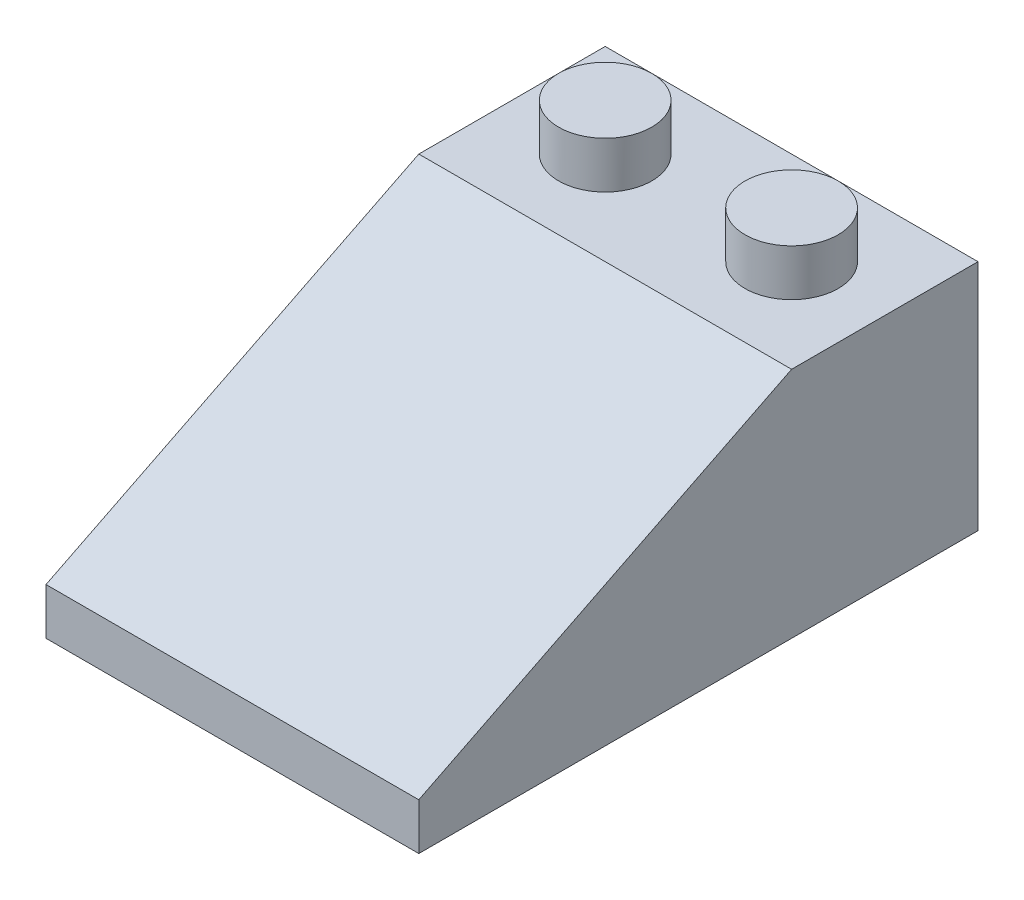
ISO-10303-21;
HEADER;
FILE_DESCRIPTION(('STEP AP214'),'2;1');
FILE_NAME('part.step','',(''),(''),'','','');
FILE_SCHEMA(('AUTOMOTIVE_DESIGN { 1 0 10303 214 1 1 1 1 }'));
ENDSEC;
DATA;
#1=APPLICATION_CONTEXT('core data for automotive mechanical design processes');
#2=APPLICATION_PROTOCOL_DEFINITION('international standard','automotive_design',2000,#1);
#3=PRODUCT_CONTEXT('',#1,'mechanical');
#4=PRODUCT('Part','Part','',(#3));
#5=PRODUCT_RELATED_PRODUCT_CATEGORY('part','',(#4));
#6=PRODUCT_DEFINITION_FORMATION('','',#4);
#7=PRODUCT_DEFINITION_CONTEXT('part definition',#1,'design');
#8=PRODUCT_DEFINITION('design','',#6,#7);
#9=PRODUCT_DEFINITION_SHAPE('','',#8);
#10=(LENGTH_UNIT() NAMED_UNIT(*) SI_UNIT(.MILLI.,.METRE.));
#11=(NAMED_UNIT(*) PLANE_ANGLE_UNIT() SI_UNIT($,.RADIAN.));
#12=(NAMED_UNIT(*) SI_UNIT($,.STERADIAN.) SOLID_ANGLE_UNIT());
#13=UNCERTAINTY_MEASURE_WITH_UNIT(LENGTH_MEASURE(1.E-05),#10,'distance_accuracy_value','');
#14=(GEOMETRIC_REPRESENTATION_CONTEXT(3) GLOBAL_UNCERTAINTY_ASSIGNED_CONTEXT((#13)) GLOBAL_UNIT_ASSIGNED_CONTEXT((#10,
#11,#12)) REPRESENTATION_CONTEXT('',''));
#15=CARTESIAN_POINT('',(0.,0.,0.));
#16=DIRECTION('',(0.,0.,1.));
#17=DIRECTION('',(1.,0.,0.));
#18=AXIS2_PLACEMENT_3D('',#15,#16,#17);
#19=CARTESIAN_POINT('',(8.,7.10557280900008,-16.4472135955));
#20=DIRECTION('',(0.,-0.894427190999916,-0.447213595499958));
#21=DIRECTION('',(0.,0.447213595499958,-0.894427190999916));
#22=AXIS2_PLACEMENT_3D('',#19,#20,#21);
#23=PLANE('',#22);
#24=CARTESIAN_POINT('',(0.,2.88196601127311,-8.));
#25=DIRECTION('',(0.,-0.894427190999916,-0.447213595499958));
#26=DIRECTION('',(0.,-0.447213595499958,0.894427190999916));
#27=AXIS2_PLACEMENT_3D('',#24,#25,#26);
#28=ELLIPSE('',#27,3.01869176962472,2.7);
#29=CARTESIAN_POINT('',(0.,1.53196601127311,-5.3));
#30=VERTEX_POINT('',#29);
#31=EDGE_CURVE('E194',#30,#30,#28,.T.);
#32=ORIENTED_EDGE('',*,*,#31,.F.);
#33=EDGE_LOOP('',(#32));
#34=FACE_BOUND('',#33,.T.);
#35=DIRECTION('',(-1.,0.,0.));
#36=VECTOR('',#35,1.);
#37=CARTESIAN_POINT('',(8.,7.,-16.2360679774998));
#38=LINE('',#37,#36);
#39=CARTESIAN_POINT('',(-2.68966018485592,7.000000000005,-16.2360679774998));
#40=VERTEX_POINT('',#39);
#41=CARTESIAN_POINT('',(-7.,7.,-16.2360679774998));
#42=VERTEX_POINT('',#41);
#43=EDGE_CURVE('E144',#40,#42,#38,.T.);
#44=ORIENTED_EDGE('',*,*,#43,.F.);
#45=CARTESIAN_POINT('',(0.,6.88196601123536,-16.));
#46=DIRECTION('',(0.,-0.894427190999916,-0.447213595499958));
#47=DIRECTION('',(0.,-0.447213595499958,0.894427190999916));
#48=AXIS2_PLACEMENT_3D('',#45,#46,#47);
#49=ELLIPSE('',#48,3.01869176962472,2.7);
#50=CARTESIAN_POINT('',(2.68966018485592,7.000000000005,-16.2360679774998));
#51=VERTEX_POINT('',#50);
#52=EDGE_CURVE('E58',#51,#40,#49,.T.);
#53=ORIENTED_EDGE('',*,*,#52,.F.);
#54=CARTESIAN_POINT('',(7.,7.,-16.2360679774998));
#55=VERTEX_POINT('',#54);
#56=EDGE_CURVE('E141',#55,#51,#38,.T.);
#57=ORIENTED_EDGE('',*,*,#56,.F.);
#58=DIRECTION('',(0.,-0.447213595499958,0.894427190999916));
#59=VECTOR('',#58,1.);
#60=CARTESIAN_POINT('',(7.,7.10557280900008,-16.4472135955));
#61=LINE('',#60,#59);
#62=CARTESIAN_POINT('',(7.,-0.618033988749895,-1.));
#63=VERTEX_POINT('',#62);
#64=EDGE_CURVE('E179',#55,#63,#61,.T.);
#65=ORIENTED_EDGE('',*,*,#64,.T.);
#66=DIRECTION('',(-1.,0.,0.));
#67=VECTOR('',#66,1.);
#68=CARTESIAN_POINT('',(8.,-0.618033988749895,-1.));
#69=LINE('',#68,#67);
#70=CARTESIAN_POINT('',(-7.,-0.618033988749895,-1.));
#71=VERTEX_POINT('',#70);
#72=EDGE_CURVE('E175',#63,#71,#69,.T.);
#73=ORIENTED_EDGE('',*,*,#72,.T.);
#74=DIRECTION('',(0.,-0.447213595499958,0.894427190999916));
#75=VECTOR('',#74,1.);
#76=CARTESIAN_POINT('',(-7.,7.10557280900008,-16.4472135955));
#77=LINE('',#76,#75);
#78=EDGE_CURVE('E170',#42,#71,#77,.T.);
#79=ORIENTED_EDGE('',*,*,#78,.F.);
#80=EDGE_LOOP('',(#44,#53,#57,#65,#73,#79));
#81=FACE_BOUND('',#80,.T.);
#82=ADVANCED_FACE('F44',(#34,#81),#23,.T.);
#83=CARTESIAN_POINT('',(8.,7.,-24.));
#84=DIRECTION('',(0.,-1.,0.));
#85=DIRECTION('',(0.,0.,-1.));
#86=AXIS2_PLACEMENT_3D('',#83,#84,#85);
#87=PLANE('',#86);
#88=CARTESIAN_POINT('',(4.,7.,-20.));
#89=DIRECTION('',(0.,-1.,0.));
#90=DIRECTION('',(0.,0.,-1.));
#91=AXIS2_PLACEMENT_3D('',#88,#89,#90);
#92=CIRCLE('',#91,1.);
#93=CARTESIAN_POINT('',(4.,7.,-21.));
#94=VERTEX_POINT('',#93);
#95=EDGE_CURVE('E165',#94,#94,#92,.F.);
#96=ORIENTED_EDGE('',*,*,#95,.T.);
#97=EDGE_LOOP('',(#96));
#98=FACE_BOUND('',#97,.T.);
#99=CARTESIAN_POINT('',(-4.,7.,-20.));
#100=DIRECTION('',(0.,-1.,0.));
#101=DIRECTION('',(0.,0.,-1.));
#102=AXIS2_PLACEMENT_3D('',#99,#100,#101);
#103=CIRCLE('',#102,1.);
#104=CARTESIAN_POINT('',(-4.,7.,-21.));
#105=VERTEX_POINT('',#104);
#106=EDGE_CURVE('E169',#105,#105,#103,.F.);
#107=ORIENTED_EDGE('',*,*,#106,.T.);
#108=EDGE_LOOP('',(#107));
#109=FACE_BOUND('',#108,.T.);
#110=ORIENTED_EDGE('',*,*,#56,.T.);
#111=CARTESIAN_POINT('',(0.,7.000000000005,-16.));
#112=DIRECTION('',(0.,-1.,0.));
#113=DIRECTION('',(0.,0.,-1.));
#114=AXIS2_PLACEMENT_3D('',#111,#112,#113);
#115=CIRCLE('',#114,2.7);
#116=EDGE_CURVE('E130',#40,#51,#115,.T.);
#117=ORIENTED_EDGE('',*,*,#116,.F.);
#118=ORIENTED_EDGE('',*,*,#43,.T.);
#119=DIRECTION('',(0.,0.,1.));
#120=VECTOR('',#119,1.);
#121=CARTESIAN_POINT('',(-7.,7.,-24.));
#122=LINE('',#121,#120);
#123=CARTESIAN_POINT('',(-7.,7.,-23.));
#124=VERTEX_POINT('',#123);
#125=EDGE_CURVE('E182',#124,#42,#122,.T.);
#126=ORIENTED_EDGE('',*,*,#125,.F.);
#127=DIRECTION('',(-1.,0.,0.));
#128=VECTOR('',#127,1.);
#129=CARTESIAN_POINT('',(8.,7.,-23.));
#130=LINE('',#129,#128);
#131=CARTESIAN_POINT('',(7.,7.,-23.));
#132=VERTEX_POINT('',#131);
#133=EDGE_CURVE('E151',#132,#124,#130,.T.);
#134=ORIENTED_EDGE('',*,*,#133,.F.);
#135=DIRECTION('',(0.,0.,1.));
#136=VECTOR('',#135,1.);
#137=CARTESIAN_POINT('',(7.,7.,-24.));
#138=LINE('',#137,#136);
#139=EDGE_CURVE('E150',#132,#55,#138,.T.);
#140=ORIENTED_EDGE('',*,*,#139,.T.);
#141=EDGE_LOOP('',(#110,#117,#118,#126,#134,#140));
#142=FACE_BOUND('',#141,.T.);
#143=ADVANCED_FACE('F147',(#98,#109,#142),#87,.T.);
#144=CARTESIAN_POINT('',(8.,-2.,0.));
#145=DIRECTION('',(0.,1.,0.));
#146=DIRECTION('',(0.,0.,1.));
#147=AXIS2_PLACEMENT_3D('',#144,#145,#146);
#148=PLANE('',#147);
#149=DIRECTION('',(0.,0.,-1.));
#150=VECTOR('',#149,1.);
#151=CARTESIAN_POINT('',(-8.,-2.,0.));
#152=LINE('',#151,#150);
#153=CARTESIAN_POINT('',(-8.,-2.,0.));
#154=VERTEX_POINT('',#153);
#155=CARTESIAN_POINT('',(-8.,-2.,-24.));
#156=VERTEX_POINT('',#155);
#157=EDGE_CURVE('E225',#154,#156,#152,.T.);
#158=ORIENTED_EDGE('',*,*,#157,.T.);
#159=DIRECTION('',(-1.,0.,0.));
#160=VECTOR('',#159,1.);
#161=CARTESIAN_POINT('',(8.,-2.,-24.));
#162=LINE('',#161,#160);
#163=CARTESIAN_POINT('',(8.,-2.,-24.));
#164=VERTEX_POINT('',#163);
#165=EDGE_CURVE('E235',#164,#156,#162,.T.);
#166=ORIENTED_EDGE('',*,*,#165,.F.);
#167=DIRECTION('',(0.,0.,-1.));
#168=VECTOR('',#167,1.);
#169=CARTESIAN_POINT('',(8.,-2.,0.));
#170=LINE('',#169,#168);
#171=CARTESIAN_POINT('',(8.,-2.,0.));
#172=VERTEX_POINT('',#171);
#173=EDGE_CURVE('E214',#172,#164,#170,.T.);
#174=ORIENTED_EDGE('',*,*,#173,.F.);
#175=DIRECTION('',(-1.,0.,0.));
#176=VECTOR('',#175,1.);
#177=CARTESIAN_POINT('',(8.,-2.,0.));
#178=LINE('',#177,#176);
#179=EDGE_CURVE('E238',#172,#154,#178,.T.);
#180=ORIENTED_EDGE('',*,*,#179,.T.);
#181=EDGE_LOOP('',(#158,#166,#174,#180));
#182=FACE_BOUND('',#181,.T.);
#183=DIRECTION('',(0.,0.,-1.));
#184=VECTOR('',#183,1.);
#185=CARTESIAN_POINT('',(-7.,-2.,0.));
#186=LINE('',#185,#184);
#187=CARTESIAN_POINT('',(-7.,-2.,-1.));
#188=VERTEX_POINT('',#187);
#189=CARTESIAN_POINT('',(-7.,-2.,-23.));
#190=VERTEX_POINT('',#189);
#191=EDGE_CURVE('E184',#188,#190,#186,.T.);
#192=ORIENTED_EDGE('',*,*,#191,.F.);
#193=DIRECTION('',(-1.,0.,0.));
#194=VECTOR('',#193,1.);
#195=CARTESIAN_POINT('',(8.,-2.,-1.));
#196=LINE('',#195,#194);
#197=CARTESIAN_POINT('',(7.,-2.,-1.));
#198=VERTEX_POINT('',#197);
#199=EDGE_CURVE('E178',#198,#188,#196,.T.);
#200=ORIENTED_EDGE('',*,*,#199,.F.);
#201=DIRECTION('',(0.,0.,-1.));
#202=VECTOR('',#201,1.);
#203=CARTESIAN_POINT('',(7.,-2.,0.));
#204=LINE('',#203,#202);
#205=CARTESIAN_POINT('',(7.,-2.,-23.));
#206=VERTEX_POINT('',#205);
#207=EDGE_CURVE('E162',#198,#206,#204,.T.);
#208=ORIENTED_EDGE('',*,*,#207,.T.);
#209=DIRECTION('',(-1.,0.,0.));
#210=VECTOR('',#209,1.);
#211=CARTESIAN_POINT('',(8.,-2.,-23.));
#212=LINE('',#211,#210);
#213=EDGE_CURVE('E155',#206,#190,#212,.T.);
#214=ORIENTED_EDGE('',*,*,#213,.T.);
#215=EDGE_LOOP('',(#192,#200,#208,#214));
#216=FACE_BOUND('',#215,.T.);
#217=ADVANCED_FACE('F253',(#182,#216),#148,.F.);
#218=CARTESIAN_POINT('',(8.,8.,-24.));
#219=DIRECTION('',(0.,-1.,0.));
#220=DIRECTION('',(0.,0.,-1.));
#221=AXIS2_PLACEMENT_3D('',#218,#219,#220);
#222=PLANE('',#221);
#223=CARTESIAN_POINT('',(-4.,8.,-20.));
#224=DIRECTION('',(0.,-1.,0.));
#225=DIRECTION('',(0.,0.,-1.));
#226=AXIS2_PLACEMENT_3D('',#223,#224,#225);
#227=CIRCLE('',#226,2.);
#228=CARTESIAN_POINT('',(-4.,8.,-22.));
#229=VERTEX_POINT('',#228);
#230=EDGE_CURVE('E244',#229,#229,#227,.F.);
#231=ORIENTED_EDGE('',*,*,#230,.F.);
#232=EDGE_LOOP('',(#231));
#233=FACE_BOUND('',#232,.T.);
#234=DIRECTION('',(0.,0.,1.));
#235=VECTOR('',#234,1.);
#236=CARTESIAN_POINT('',(-8.,8.,-24.));
#237=LINE('',#236,#235);
#238=CARTESIAN_POINT('',(-8.,8.,-24.));
#239=VERTEX_POINT('',#238);
#240=CARTESIAN_POINT('',(-8.,8.,-16.));
#241=VERTEX_POINT('',#240);
#242=EDGE_CURVE('E212',#239,#241,#237,.T.);
#243=ORIENTED_EDGE('',*,*,#242,.T.);
#244=DIRECTION('',(-1.,0.,0.));
#245=VECTOR('',#244,1.);
#246=CARTESIAN_POINT('',(8.,8.,-16.));
#247=LINE('',#246,#245);
#248=CARTESIAN_POINT('',(8.,8.,-16.));
#249=VERTEX_POINT('',#248);
#250=EDGE_CURVE('E220',#249,#241,#247,.T.);
#251=ORIENTED_EDGE('',*,*,#250,.F.);
#252=DIRECTION('',(0.,0.,1.));
#253=VECTOR('',#252,1.);
#254=CARTESIAN_POINT('',(8.,8.,-24.));
#255=LINE('',#254,#253);
#256=CARTESIAN_POINT('',(8.,8.,-24.));
#257=VERTEX_POINT('',#256);
#258=EDGE_CURVE('E218',#257,#249,#255,.T.);
#259=ORIENTED_EDGE('',*,*,#258,.F.);
#260=DIRECTION('',(-1.,0.,0.));
#261=VECTOR('',#260,1.);
#262=CARTESIAN_POINT('',(8.,8.,-24.));
#263=LINE('',#262,#261);
#264=EDGE_CURVE('E232',#257,#239,#263,.T.);
#265=ORIENTED_EDGE('',*,*,#264,.T.);
#266=EDGE_LOOP('',(#243,#251,#259,#265));
#267=FACE_BOUND('',#266,.T.);
#268=CARTESIAN_POINT('',(4.,8.,-20.));
#269=DIRECTION('',(0.,-1.,0.));
#270=DIRECTION('',(0.,0.,-1.));
#271=AXIS2_PLACEMENT_3D('',#268,#269,#270);
#272=CIRCLE('',#271,2.);
#273=CARTESIAN_POINT('',(4.,8.,-22.));
#274=VERTEX_POINT('',#273);
#275=EDGE_CURVE('E52',#274,#274,#272,.F.);
#276=ORIENTED_EDGE('',*,*,#275,.F.);
#277=EDGE_LOOP('',(#276));
#278=FACE_BOUND('',#277,.T.);
#279=ADVANCED_FACE('F251',(#233,#267,#278),#222,.F.);
#280=CARTESIAN_POINT('',(8.,8.,-16.));
#281=DIRECTION('',(0.,-0.894427190999916,-0.447213595499958));
#282=DIRECTION('',(0.,0.447213595499958,-0.894427190999916));
#283=AXIS2_PLACEMENT_3D('',#280,#281,#282);
#284=PLANE('',#283);
#285=DIRECTION('',(0.,-0.447213595499958,0.894427190999916));
#286=VECTOR('',#285,1.);
#287=CARTESIAN_POINT('',(-8.,8.,-16.));
#288=LINE('',#287,#286);
#289=CARTESIAN_POINT('',(-8.,0.,0.));
#290=VERTEX_POINT('',#289);
#291=EDGE_CURVE('E207',#241,#290,#288,.T.);
#292=ORIENTED_EDGE('',*,*,#291,.T.);
#293=DIRECTION('',(-1.,0.,0.));
#294=VECTOR('',#293,1.);
#295=CARTESIAN_POINT('',(8.,0.,0.));
#296=LINE('',#295,#294);
#297=CARTESIAN_POINT('',(8.,0.,0.));
#298=VERTEX_POINT('',#297);
#299=EDGE_CURVE('E241',#298,#290,#296,.T.);
#300=ORIENTED_EDGE('',*,*,#299,.F.);
#301=DIRECTION('',(0.,-0.447213595499958,0.894427190999916));
#302=VECTOR('',#301,1.);
#303=CARTESIAN_POINT('',(8.,8.,-16.));
#304=LINE('',#303,#302);
#305=EDGE_CURVE('E208',#249,#298,#304,.T.);
#306=ORIENTED_EDGE('',*,*,#305,.F.);
#307=ORIENTED_EDGE('',*,*,#250,.T.);
#308=EDGE_LOOP('',(#292,#300,#306,#307));
#309=FACE_BOUND('',#308,.T.);
#310=ADVANCED_FACE('F46',(#309),#284,.F.);
#311=CARTESIAN_POINT('',(8.,0.,0.));
#312=DIRECTION('',(0.,0.,-1.));
#313=DIRECTION('',(-1.,0.,0.));
#314=AXIS2_PLACEMENT_3D('',#311,#312,#313);
#315=PLANE('',#314);
#316=DIRECTION('',(0.,-1.,0.));
#317=VECTOR('',#316,1.);
#318=CARTESIAN_POINT('',(-8.,0.,0.));
#319=LINE('',#318,#317);
#320=EDGE_CURVE('E223',#290,#154,#319,.T.);
#321=ORIENTED_EDGE('',*,*,#320,.T.);
#322=ORIENTED_EDGE('',*,*,#179,.F.);
#323=DIRECTION('',(0.,-1.,0.));
#324=VECTOR('',#323,1.);
#325=CARTESIAN_POINT('',(8.,0.,0.));
#326=LINE('',#325,#324);
#327=EDGE_CURVE('E211',#298,#172,#326,.T.);
#328=ORIENTED_EDGE('',*,*,#327,.F.);
#329=ORIENTED_EDGE('',*,*,#299,.T.);
#330=EDGE_LOOP('',(#321,#322,#328,#329));
#331=FACE_BOUND('',#330,.T.);
#332=ADVANCED_FACE('F260',(#331),#315,.F.);
#333=CARTESIAN_POINT('',(8.,-2.,-24.));
#334=DIRECTION('',(0.,0.,1.));
#335=DIRECTION('',(1.,0.,0.));
#336=AXIS2_PLACEMENT_3D('',#333,#334,#335);
#337=PLANE('',#336);
#338=DIRECTION('',(0.,1.,0.));
#339=VECTOR('',#338,1.);
#340=CARTESIAN_POINT('',(-8.,-2.,-24.));
#341=LINE('',#340,#339);
#342=EDGE_CURVE('E227',#156,#239,#341,.T.);
#343=ORIENTED_EDGE('',*,*,#342,.T.);
#344=ORIENTED_EDGE('',*,*,#264,.F.);
#345=DIRECTION('',(0.,1.,0.));
#346=VECTOR('',#345,1.);
#347=CARTESIAN_POINT('',(8.,-2.,-24.));
#348=LINE('',#347,#346);
#349=EDGE_CURVE('E216',#164,#257,#348,.T.);
#350=ORIENTED_EDGE('',*,*,#349,.F.);
#351=ORIENTED_EDGE('',*,*,#165,.T.);
#352=EDGE_LOOP('',(#343,#344,#350,#351));
#353=FACE_BOUND('',#352,.T.);
#354=ADVANCED_FACE('F449',(#353),#337,.F.);
#355=CARTESIAN_POINT('',(8.,0.,0.));
#356=DIRECTION('',(1.,0.,0.));
#357=DIRECTION('',(0.,0.,-1.));
#358=AXIS2_PLACEMENT_3D('',#355,#356,#357);
#359=PLANE('',#358);
#360=ORIENTED_EDGE('',*,*,#305,.T.);
#361=ORIENTED_EDGE('',*,*,#327,.T.);
#362=ORIENTED_EDGE('',*,*,#173,.T.);
#363=ORIENTED_EDGE('',*,*,#349,.T.);
#364=ORIENTED_EDGE('',*,*,#258,.T.);
#365=EDGE_LOOP('',(#360,#361,#362,#363,#364));
#366=FACE_BOUND('',#365,.T.);
#367=ADVANCED_FACE('F447',(#366),#359,.T.);
#368=CARTESIAN_POINT('',(-8.,0.,0.));
#369=DIRECTION('',(1.,0.,0.));
#370=DIRECTION('',(0.,0.,-1.));
#371=AXIS2_PLACEMENT_3D('',#368,#369,#370);
#372=PLANE('',#371);
#373=ORIENTED_EDGE('',*,*,#291,.F.);
#374=ORIENTED_EDGE('',*,*,#242,.F.);
#375=ORIENTED_EDGE('',*,*,#342,.F.);
#376=ORIENTED_EDGE('',*,*,#157,.F.);
#377=ORIENTED_EDGE('',*,*,#320,.F.);
#378=EDGE_LOOP('',(#373,#374,#375,#376,#377));
#379=FACE_BOUND('',#378,.T.);
#380=ADVANCED_FACE('F445',(#379),#372,.F.);
#381=CARTESIAN_POINT('',(-4.,10.,-20.));
#382=DIRECTION('',(0.,-1.,0.));
#383=DIRECTION('',(0.,0.,-1.));
#384=AXIS2_PLACEMENT_3D('',#381,#382,#383);
#385=CYLINDRICAL_SURFACE('',#384,2.);
#386=CARTESIAN_POINT('',(-4.,10.,-20.));
#387=DIRECTION('',(0.,1.,0.));
#388=DIRECTION('',(0.,0.,1.));
#389=AXIS2_PLACEMENT_3D('',#386,#387,#388);
#390=CIRCLE('',#389,2.);
#391=CARTESIAN_POINT('',(-4.,10.,-18.));
#392=VERTEX_POINT('',#391);
#393=EDGE_CURVE('E204',#392,#392,#390,.T.);
#394=ORIENTED_EDGE('',*,*,#393,.F.);
#395=EDGE_LOOP('',(#394));
#396=FACE_BOUND('',#395,.T.);
#397=ORIENTED_EDGE('',*,*,#230,.T.);
#398=EDGE_LOOP('',(#397));
#399=FACE_BOUND('',#398,.T.);
#400=ADVANCED_FACE('F441',(#396,#399),#385,.T.);
#401=CARTESIAN_POINT('',(-4.,10.,-20.));
#402=DIRECTION('',(0.,1.,0.));
#403=DIRECTION('',(0.,0.,1.));
#404=AXIS2_PLACEMENT_3D('',#401,#402,#403);
#405=PLANE('',#404);
#406=ORIENTED_EDGE('',*,*,#393,.T.);
#407=EDGE_LOOP('',(#406));
#408=FACE_BOUND('',#407,.T.);
#409=ADVANCED_FACE('F437',(#408),#405,.T.);
#410=CARTESIAN_POINT('',(4.,10.,-20.));
#411=DIRECTION('',(0.,-1.,0.));
#412=DIRECTION('',(0.,0.,-1.));
#413=AXIS2_PLACEMENT_3D('',#410,#411,#412);
#414=CYLINDRICAL_SURFACE('',#413,2.);
#415=CARTESIAN_POINT('',(4.,10.,-20.));
#416=DIRECTION('',(0.,1.,0.));
#417=DIRECTION('',(0.,0.,-1.));
#418=AXIS2_PLACEMENT_3D('',#415,#416,#417);
#419=CIRCLE('',#418,2.);
#420=CARTESIAN_POINT('',(4.,10.,-22.));
#421=VERTEX_POINT('',#420);
#422=EDGE_CURVE('E168',#421,#421,#419,.T.);
#423=ORIENTED_EDGE('',*,*,#422,.F.);
#424=EDGE_LOOP('',(#423));
#425=FACE_BOUND('',#424,.T.);
#426=ORIENTED_EDGE('',*,*,#275,.T.);
#427=EDGE_LOOP('',(#426));
#428=FACE_BOUND('',#427,.T.);
#429=ADVANCED_FACE('F249',(#425,#428),#414,.T.);
#430=CARTESIAN_POINT('',(4.,10.,-20.));
#431=DIRECTION('',(0.,-1.,0.));
#432=DIRECTION('',(0.,0.,-1.));
#433=AXIS2_PLACEMENT_3D('',#430,#431,#432);
#434=PLANE('',#433);
#435=ORIENTED_EDGE('',*,*,#422,.T.);
#436=EDGE_LOOP('',(#435));
#437=FACE_BOUND('',#436,.T.);
#438=ADVANCED_FACE('F431',(#437),#434,.F.);
#439=CARTESIAN_POINT('',(8.,0.,-1.));
#440=DIRECTION('',(0.,0.,-1.));
#441=DIRECTION('',(-1.,0.,0.));
#442=AXIS2_PLACEMENT_3D('',#439,#440,#441);
#443=PLANE('',#442);
#444=DIRECTION('',(0.,-1.,0.));
#445=VECTOR('',#444,1.);
#446=CARTESIAN_POINT('',(-7.,0.,-1.));
#447=LINE('',#446,#445);
#448=EDGE_CURVE('E173',#71,#188,#447,.T.);
#449=ORIENTED_EDGE('',*,*,#448,.F.);
#450=ORIENTED_EDGE('',*,*,#72,.F.);
#451=DIRECTION('',(0.,-1.,0.));
#452=VECTOR('',#451,1.);
#453=CARTESIAN_POINT('',(7.,0.,-1.));
#454=LINE('',#453,#452);
#455=EDGE_CURVE('E181',#63,#198,#454,.T.);
#456=ORIENTED_EDGE('',*,*,#455,.T.);
#457=ORIENTED_EDGE('',*,*,#199,.T.);
#458=EDGE_LOOP('',(#449,#450,#456,#457));
#459=FACE_BOUND('',#458,.T.);
#460=ADVANCED_FACE('F402',(#459),#443,.T.);
#461=CARTESIAN_POINT('',(8.,-2.,-23.));
#462=DIRECTION('',(0.,0.,1.));
#463=DIRECTION('',(1.,0.,0.));
#464=AXIS2_PLACEMENT_3D('',#461,#462,#463);
#465=PLANE('',#464);
#466=DIRECTION('',(0.,1.,0.));
#467=VECTOR('',#466,1.);
#468=CARTESIAN_POINT('',(-7.,-2.,-23.));
#469=LINE('',#468,#467);
#470=EDGE_CURVE('E187',#190,#124,#469,.T.);
#471=ORIENTED_EDGE('',*,*,#470,.F.);
#472=ORIENTED_EDGE('',*,*,#213,.F.);
#473=DIRECTION('',(0.,1.,0.));
#474=VECTOR('',#473,1.);
#475=CARTESIAN_POINT('',(7.,-2.,-23.));
#476=LINE('',#475,#474);
#477=EDGE_CURVE('E161',#206,#132,#476,.T.);
#478=ORIENTED_EDGE('',*,*,#477,.T.);
#479=ORIENTED_EDGE('',*,*,#133,.T.);
#480=EDGE_LOOP('',(#471,#472,#478,#479));
#481=FACE_BOUND('',#480,.T.);
#482=ADVANCED_FACE('F407',(#481),#465,.T.);
#483=CARTESIAN_POINT('',(7.,0.,0.));
#484=DIRECTION('',(1.,0.,0.));
#485=DIRECTION('',(0.,0.,-1.));
#486=AXIS2_PLACEMENT_3D('',#483,#484,#485);
#487=PLANE('',#486);
#488=ORIENTED_EDGE('',*,*,#64,.F.);
#489=ORIENTED_EDGE('',*,*,#139,.F.);
#490=ORIENTED_EDGE('',*,*,#477,.F.);
#491=ORIENTED_EDGE('',*,*,#207,.F.);
#492=ORIENTED_EDGE('',*,*,#455,.F.);
#493=EDGE_LOOP('',(#488,#489,#490,#491,#492));
#494=FACE_BOUND('',#493,.T.);
#495=ADVANCED_FACE('F410',(#494),#487,.F.);
#496=CARTESIAN_POINT('',(-7.,0.,0.));
#497=DIRECTION('',(1.,0.,0.));
#498=DIRECTION('',(0.,0.,-1.));
#499=AXIS2_PLACEMENT_3D('',#496,#497,#498);
#500=PLANE('',#499);
#501=ORIENTED_EDGE('',*,*,#78,.T.);
#502=ORIENTED_EDGE('',*,*,#448,.T.);
#503=ORIENTED_EDGE('',*,*,#191,.T.);
#504=ORIENTED_EDGE('',*,*,#470,.T.);
#505=ORIENTED_EDGE('',*,*,#125,.T.);
#506=EDGE_LOOP('',(#501,#502,#503,#504,#505));
#507=FACE_BOUND('',#506,.T.);
#508=ADVANCED_FACE('F398',(#507),#500,.T.);
#509=CARTESIAN_POINT('',(-4.,10.,-20.));
#510=DIRECTION('',(0.,-1.,0.));
#511=DIRECTION('',(0.,0.,-1.));
#512=AXIS2_PLACEMENT_3D('',#509,#510,#511);
#513=CYLINDRICAL_SURFACE('',#512,1.);
#514=CARTESIAN_POINT('',(-4.,9.,-20.));
#515=DIRECTION('',(0.,1.,0.));
#516=DIRECTION('',(0.,0.,1.));
#517=AXIS2_PLACEMENT_3D('',#514,#515,#516);
#518=CIRCLE('',#517,1.);
#519=CARTESIAN_POINT('',(-4.,9.,-19.));
#520=VERTEX_POINT('',#519);
#521=EDGE_CURVE('E174',#520,#520,#518,.T.);
#522=ORIENTED_EDGE('',*,*,#521,.T.);
#523=EDGE_LOOP('',(#522));
#524=FACE_BOUND('',#523,.T.);
#525=ORIENTED_EDGE('',*,*,#106,.F.);
#526=EDGE_LOOP('',(#525));
#527=FACE_BOUND('',#526,.T.);
#528=ADVANCED_FACE('F417',(#524,#527),#513,.F.);
#529=CARTESIAN_POINT('',(-4.,9.,-20.));
#530=DIRECTION('',(0.,1.,0.));
#531=DIRECTION('',(0.,0.,1.));
#532=AXIS2_PLACEMENT_3D('',#529,#530,#531);
#533=PLANE('',#532);
#534=ORIENTED_EDGE('',*,*,#521,.F.);
#535=EDGE_LOOP('',(#534));
#536=FACE_BOUND('',#535,.T.);
#537=ADVANCED_FACE('F423',(#536),#533,.F.);
#538=CARTESIAN_POINT('',(4.,10.,-20.));
#539=DIRECTION('',(0.,-1.,0.));
#540=DIRECTION('',(0.,0.,-1.));
#541=AXIS2_PLACEMENT_3D('',#538,#539,#540);
#542=CYLINDRICAL_SURFACE('',#541,1.);
#543=CARTESIAN_POINT('',(4.,9.,-20.));
#544=DIRECTION('',(0.,-1.,0.));
#545=DIRECTION('',(0.,0.,-1.));
#546=AXIS2_PLACEMENT_3D('',#543,#544,#545);
#547=CIRCLE('',#546,1.);
#548=CARTESIAN_POINT('',(4.,9.,-21.));
#549=VERTEX_POINT('',#548);
#550=EDGE_CURVE('E191',#549,#549,#547,.F.);
#551=ORIENTED_EDGE('',*,*,#550,.T.);
#552=EDGE_LOOP('',(#551));
#553=FACE_BOUND('',#552,.T.);
#554=ORIENTED_EDGE('',*,*,#95,.F.);
#555=EDGE_LOOP('',(#554));
#556=FACE_BOUND('',#555,.T.);
#557=ADVANCED_FACE('F311',(#553,#556),#542,.F.);
#558=CARTESIAN_POINT('',(4.,9.,-20.));
#559=DIRECTION('',(0.,-1.,0.));
#560=DIRECTION('',(0.,0.,-1.));
#561=AXIS2_PLACEMENT_3D('',#558,#559,#560);
#562=PLANE('',#561);
#563=ORIENTED_EDGE('',*,*,#550,.F.);
#564=EDGE_LOOP('',(#563));
#565=FACE_BOUND('',#564,.T.);
#566=ADVANCED_FACE('F298',(#565),#562,.T.);
#567=CARTESIAN_POINT('',(0.,0.,-8.));
#568=DIRECTION('',(0.,1.,0.));
#569=DIRECTION('',(0.,0.,1.));
#570=AXIS2_PLACEMENT_3D('',#567,#568,#569);
#571=PLANE('',#570);
#572=CARTESIAN_POINT('',(0.,0.,-8.));
#573=DIRECTION('',(0.,1.,0.));
#574=DIRECTION('',(0.,0.,1.));
#575=AXIS2_PLACEMENT_3D('',#572,#573,#574);
#576=CIRCLE('',#575,1.7);
#577=CARTESIAN_POINT('',(0.,0.,-6.3));
#578=VERTEX_POINT('',#577);
#579=EDGE_CURVE('E390',#578,#578,#576,.T.);
#580=ORIENTED_EDGE('',*,*,#579,.T.);
#581=EDGE_LOOP('',(#580));
#582=FACE_BOUND('',#581,.T.);
#583=CARTESIAN_POINT('',(0.,0.,-8.));
#584=DIRECTION('',(0.,1.,0.));
#585=DIRECTION('',(0.,0.,1.));
#586=AXIS2_PLACEMENT_3D('',#583,#584,#585);
#587=CIRCLE('',#586,2.7);
#588=CARTESIAN_POINT('',(0.,0.,-5.3));
#589=VERTEX_POINT('',#588);
#590=EDGE_CURVE('E388',#589,#589,#587,.T.);
#591=ORIENTED_EDGE('',*,*,#590,.F.);
#592=EDGE_LOOP('',(#591));
#593=FACE_BOUND('',#592,.T.);
#594=ADVANCED_FACE('F287',(#582,#593),#571,.F.);
#595=CARTESIAN_POINT('',(0.,500000.,-8.));
#596=DIRECTION('',(0.,-1.,0.));
#597=DIRECTION('',(0.,0.,-1.));
#598=AXIS2_PLACEMENT_3D('',#595,#596,#597);
#599=CYLINDRICAL_SURFACE('',#598,2.7);
#600=ORIENTED_EDGE('',*,*,#31,.T.);
#601=EDGE_LOOP('',(#600));
#602=FACE_BOUND('',#601,.T.);
#603=ORIENTED_EDGE('',*,*,#590,.T.);
#604=EDGE_LOOP('',(#603));
#605=FACE_BOUND('',#604,.T.);
#606=ADVANCED_FACE('F295',(#602,#605),#599,.T.);
#607=CARTESIAN_POINT('',(0.,500000.,-8.));
#608=DIRECTION('',(0.,-1.,0.));
#609=DIRECTION('',(0.,0.,-1.));
#610=AXIS2_PLACEMENT_3D('',#607,#608,#609);
#611=CYLINDRICAL_SURFACE('',#610,1.7);
#612=CARTESIAN_POINT('',(0.,2.88196601127311,-8.));
#613=DIRECTION('',(0.,-0.894427190999916,-0.447213595499958));
#614=DIRECTION('',(0.,-0.447213595499958,0.894427190999916));
#615=AXIS2_PLACEMENT_3D('',#612,#613,#614);
#616=ELLIPSE('',#615,1.90065778087482,1.7);
#617=CARTESIAN_POINT('',(0.,2.03196601127311,-6.3));
#618=VERTEX_POINT('',#617);
#619=EDGE_CURVE('E12',#618,#618,#616,.F.);
#620=ORIENTED_EDGE('',*,*,#619,.T.);
#621=EDGE_LOOP('',(#620));
#622=FACE_BOUND('',#621,.T.);
#623=ORIENTED_EDGE('',*,*,#579,.F.);
#624=EDGE_LOOP('',(#623));
#625=FACE_BOUND('',#624,.T.);
#626=ADVANCED_FACE('F285',(#622,#625),#611,.F.);
#627=ORIENTED_EDGE('',*,*,#619,.F.);
#628=EDGE_LOOP('',(#627));
#629=FACE_BOUND('',#628,.T.);
#630=ADVANCED_FACE('F272',(#629),#23,.T.);
#631=CARTESIAN_POINT('',(0.,0.,-16.));
#632=DIRECTION('',(0.,-1.,0.));
#633=DIRECTION('',(0.,0.,-1.));
#634=AXIS2_PLACEMENT_3D('',#631,#632,#633);
#635=PLANE('',#634);
#636=CARTESIAN_POINT('',(0.,0.,-16.));
#637=DIRECTION('',(0.,1.,0.));
#638=DIRECTION('',(0.,0.,-1.));
#639=AXIS2_PLACEMENT_3D('',#636,#637,#638);
#640=CIRCLE('',#639,2.7);
#641=CARTESIAN_POINT('',(0.,0.,-18.7));
#642=VERTEX_POINT('',#641);
#643=EDGE_CURVE('E382',#642,#642,#640,.T.);
#644=ORIENTED_EDGE('',*,*,#643,.F.);
#645=EDGE_LOOP('',(#644));
#646=FACE_BOUND('',#645,.T.);
#647=CARTESIAN_POINT('',(0.,0.,-16.));
#648=DIRECTION('',(0.,1.,0.));
#649=DIRECTION('',(0.,0.,-1.));
#650=AXIS2_PLACEMENT_3D('',#647,#648,#649);
#651=CIRCLE('',#650,1.7);
#652=CARTESIAN_POINT('',(0.,0.,-17.7));
#653=VERTEX_POINT('',#652);
#654=EDGE_CURVE('E136',#653,#653,#651,.T.);
#655=ORIENTED_EDGE('',*,*,#654,.T.);
#656=EDGE_LOOP('',(#655));
#657=FACE_BOUND('',#656,.T.);
#658=ADVANCED_FACE('F284',(#646,#657),#635,.T.);
#659=CARTESIAN_POINT('',(0.,500000.,-16.));
#660=DIRECTION('',(0.,-1.,0.));
#661=DIRECTION('',(0.,0.,-1.));
#662=AXIS2_PLACEMENT_3D('',#659,#660,#661);
#663=CYLINDRICAL_SURFACE('',#662,1.7);
#664=CARTESIAN_POINT('',(0.,6.88196601123536,-16.));
#665=DIRECTION('',(0.,-0.894427190999916,-0.447213595499958));
#666=DIRECTION('',(0.,-0.447213595499958,0.894427190999916));
#667=AXIS2_PLACEMENT_3D('',#664,#665,#666);
#668=ELLIPSE('',#667,1.90065778087482,1.7);
#669=CARTESIAN_POINT('',(1.68352959878915,7.000000000005,-16.2360679774998));
#670=VERTEX_POINT('',#669);
#671=CARTESIAN_POINT('',(-1.68352959878915,7.000000000005,-16.2360679774998));
#672=VERTEX_POINT('',#671);
#673=EDGE_CURVE('E145',#670,#672,#668,.T.);
#674=ORIENTED_EDGE('',*,*,#673,.F.);
#675=CARTESIAN_POINT('',(0.,7.000000000005,-16.));
#676=DIRECTION('',(0.,-1.,0.));
#677=DIRECTION('',(0.,0.,-1.));
#678=AXIS2_PLACEMENT_3D('',#675,#676,#677);
#679=CIRCLE('',#678,1.7);
#680=EDGE_CURVE('E65',#672,#670,#679,.T.);
#681=ORIENTED_EDGE('',*,*,#680,.F.);
#682=EDGE_LOOP('',(#674,#681));
#683=FACE_BOUND('',#682,.T.);
#684=ORIENTED_EDGE('',*,*,#654,.F.);
#685=EDGE_LOOP('',(#684));
#686=FACE_BOUND('',#685,.T.);
#687=ADVANCED_FACE('F292',(#683,#686),#663,.F.);
#688=CARTESIAN_POINT('',(0.,500000.,-16.));
#689=DIRECTION('',(0.,-1.,0.));
#690=DIRECTION('',(0.,0.,-1.));
#691=AXIS2_PLACEMENT_3D('',#688,#689,#690);
#692=CYLINDRICAL_SURFACE('',#691,2.7);
#693=ORIENTED_EDGE('',*,*,#116,.T.);
#694=ORIENTED_EDGE('',*,*,#52,.T.);
#695=EDGE_LOOP('',(#693,#694));
#696=FACE_BOUND('',#695,.T.);
#697=ORIENTED_EDGE('',*,*,#643,.T.);
#698=EDGE_LOOP('',(#697));
#699=FACE_BOUND('',#698,.T.);
#700=ADVANCED_FACE('F131',(#696,#699),#692,.T.);
#701=ORIENTED_EDGE('',*,*,#680,.T.);
#702=EDGE_CURVE('E152',#670,#672,#38,.T.);
#703=ORIENTED_EDGE('',*,*,#702,.T.);
#704=EDGE_LOOP('',(#701,#703));
#705=FACE_BOUND('',#704,.T.);
#706=ADVANCED_FACE('F278',(#705),#87,.T.);
#707=ORIENTED_EDGE('',*,*,#673,.T.);
#708=ORIENTED_EDGE('',*,*,#702,.F.);
#709=EDGE_LOOP('',(#707,#708));
#710=FACE_BOUND('',#709,.T.);
#711=ADVANCED_FACE('F271',(#710),#23,.T.);
#712=CLOSED_SHELL('',(#82,#143,#217,#279,#310,#332,#354,#367,#380,#400,#409,#429,#438,#460,#482,
#495,#508,#528,#537,#557,#566,#594,#606,#626,#630,#658,#687,#700,#706,#711));
#713=MANIFOLD_SOLID_BREP('B2',#712);
#714=ADVANCED_BREP_SHAPE_REPRESENTATION('',(#18,#713),#14);
#715=SHAPE_DEFINITION_REPRESENTATION(#9,#714);
ENDSEC;
END-ISO-10303-21;
